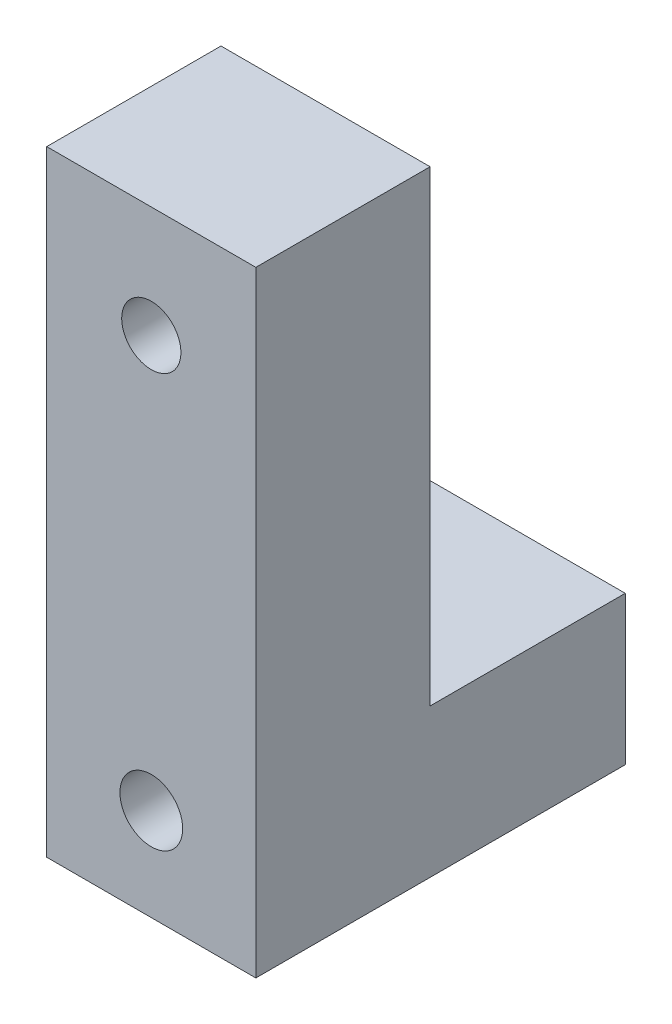
ISO-10303-21;
HEADER;
FILE_DESCRIPTION(('STEP AP214'),'2;1');
FILE_NAME('part.step','',(''),(''),'','','');
FILE_SCHEMA(('AUTOMOTIVE_DESIGN { 1 0 10303 214 1 1 1 1 }'));
ENDSEC;
DATA;
#1=APPLICATION_CONTEXT('core data for automotive mechanical design processes');
#2=APPLICATION_PROTOCOL_DEFINITION('international standard','automotive_design',2000,#1);
#3=PRODUCT_CONTEXT('',#1,'mechanical');
#4=PRODUCT('Part','Part','',(#3));
#5=PRODUCT_RELATED_PRODUCT_CATEGORY('part','',(#4));
#6=PRODUCT_DEFINITION_FORMATION('','',#4);
#7=PRODUCT_DEFINITION_CONTEXT('part definition',#1,'design');
#8=PRODUCT_DEFINITION('design','',#6,#7);
#9=PRODUCT_DEFINITION_SHAPE('','',#8);
#10=(LENGTH_UNIT() NAMED_UNIT(*) SI_UNIT(.MILLI.,.METRE.));
#11=(NAMED_UNIT(*) PLANE_ANGLE_UNIT() SI_UNIT($,.RADIAN.));
#12=(NAMED_UNIT(*) SI_UNIT($,.STERADIAN.) SOLID_ANGLE_UNIT());
#13=UNCERTAINTY_MEASURE_WITH_UNIT(LENGTH_MEASURE(1.E-05),#10,'distance_accuracy_value','');
#14=(GEOMETRIC_REPRESENTATION_CONTEXT(3) GLOBAL_UNCERTAINTY_ASSIGNED_CONTEXT((#13)) GLOBAL_UNIT_ASSIGNED_CONTEXT((#10,
#11,#12)) REPRESENTATION_CONTEXT('',''));
#15=CARTESIAN_POINT('',(0.,0.,0.));
#16=DIRECTION('',(0.,0.,1.));
#17=DIRECTION('',(1.,0.,0.));
#18=AXIS2_PLACEMENT_3D('',#15,#16,#17);
#19=CARTESIAN_POINT('',(15.,59.038200962956,71.5));
#20=DIRECTION('',(0.,0.,-1.));
#21=DIRECTION('',(-1.,0.,0.));
#22=AXIS2_PLACEMENT_3D('',#19,#20,#21);
#23=CYLINDRICAL_SURFACE('',#22,4.25);
#24=CARTESIAN_POINT('',(15.,59.038200962956,71.5));
#25=DIRECTION('',(0.,0.,-1.));
#26=DIRECTION('',(-1.,0.,0.));
#27=AXIS2_PLACEMENT_3D('',#24,#25,#26);
#28=CIRCLE('',#27,4.25);
#29=CARTESIAN_POINT('',(10.75,59.038200962956,71.5));
#30=VERTEX_POINT('',#29);
#31=EDGE_CURVE('E149',#30,#30,#28,.T.);
#32=ORIENTED_EDGE('',*,*,#31,.F.);
#33=EDGE_LOOP('',(#32));
#34=FACE_BOUND('',#33,.T.);
#35=CARTESIAN_POINT('',(15.,59.038200962956,54.5));
#36=DIRECTION('',(0.,0.,-1.));
#37=DIRECTION('',(-1.,0.,0.));
#38=AXIS2_PLACEMENT_3D('',#35,#36,#37);
#39=CIRCLE('',#38,4.25);
#40=CARTESIAN_POINT('',(10.75,59.038200962956,54.5));
#41=VERTEX_POINT('',#40);
#42=EDGE_CURVE('E37',#41,#41,#39,.F.);
#43=ORIENTED_EDGE('',*,*,#42,.F.);
#44=EDGE_LOOP('',(#43));
#45=FACE_BOUND('',#44,.T.);
#46=ADVANCED_FACE('F33',(#34,#45),#23,.F.);
#47=CARTESIAN_POINT('',(30.,8.00000000000004,46.5));
#48=DIRECTION('',(0.,-1.,0.));
#49=DIRECTION('',(0.,0.,-1.));
#50=AXIS2_PLACEMENT_3D('',#47,#48,#49);
#51=PLANE('',#50);
#52=DIRECTION('',(0.,0.,1.));
#53=VECTOR('',#52,1.);
#54=CARTESIAN_POINT('',(0.,8.00000000000004,46.5));
#55=LINE('',#54,#53);
#56=CARTESIAN_POINT('',(0.,8.00000000000004,18.5));
#57=VERTEX_POINT('',#56);
#58=CARTESIAN_POINT('',(0.,8.00000000000004,46.5));
#59=VERTEX_POINT('',#58);
#60=EDGE_CURVE('E120',#57,#59,#55,.T.);
#61=ORIENTED_EDGE('',*,*,#60,.T.);
#62=DIRECTION('',(-1.,0.,0.));
#63=VECTOR('',#62,1.);
#64=CARTESIAN_POINT('',(30.,8.00000000000004,46.5));
#65=LINE('',#64,#63);
#66=CARTESIAN_POINT('',(30.,8.00000000000004,46.5));
#67=VERTEX_POINT('',#66);
#68=EDGE_CURVE('E11',#67,#59,#65,.T.);
#69=ORIENTED_EDGE('',*,*,#68,.F.);
#70=DIRECTION('',(0.,0.,1.));
#71=VECTOR('',#70,1.);
#72=CARTESIAN_POINT('',(30.,8.00000000000004,46.5));
#73=LINE('',#72,#71);
#74=CARTESIAN_POINT('',(30.,8.00000000000004,18.5));
#75=VERTEX_POINT('',#74);
#76=EDGE_CURVE('E131',#75,#67,#73,.T.);
#77=ORIENTED_EDGE('',*,*,#76,.F.);
#78=DIRECTION('',(-1.,0.,0.));
#79=VECTOR('',#78,1.);
#80=CARTESIAN_POINT('',(30.,8.00000000000004,18.5));
#81=LINE('',#80,#79);
#82=EDGE_CURVE('E116',#75,#57,#81,.T.);
#83=ORIENTED_EDGE('',*,*,#82,.T.);
#84=EDGE_LOOP('',(#61,#69,#77,#83));
#85=FACE_BOUND('',#84,.T.);
#86=ADVANCED_FACE('F35',(#85),#51,.F.);
#87=CARTESIAN_POINT('',(30.,8.00000000000004,46.5));
#88=DIRECTION('',(0.,0.,1.));
#89=DIRECTION('',(1.,0.,0.));
#90=AXIS2_PLACEMENT_3D('',#87,#88,#89);
#91=PLANE('',#90);
#92=CARTESIAN_POINT('',(15.,59.038200962956,46.5));
#93=DIRECTION('',(0.,0.,-1.));
#94=DIRECTION('',(-1.,0.,0.));
#95=AXIS2_PLACEMENT_3D('',#92,#93,#94);
#96=CIRCLE('',#95,7.);
#97=CARTESIAN_POINT('',(8.,59.038200962956,46.5));
#98=VERTEX_POINT('',#97);
#99=EDGE_CURVE('E294',#98,#98,#96,.T.);
#100=ORIENTED_EDGE('',*,*,#99,.F.);
#101=EDGE_LOOP('',(#100));
#102=FACE_BOUND('',#101,.T.);
#103=DIRECTION('',(0.,1.,0.));
#104=VECTOR('',#103,1.);
#105=CARTESIAN_POINT('',(0.,8.00000000000004,46.5));
#106=LINE('',#105,#104);
#107=CARTESIAN_POINT('',(0.,75.,46.5));
#108=VERTEX_POINT('',#107);
#109=EDGE_CURVE('E123',#59,#108,#106,.T.);
#110=ORIENTED_EDGE('',*,*,#109,.T.);
#111=DIRECTION('',(-1.,0.,0.));
#112=VECTOR('',#111,1.);
#113=CARTESIAN_POINT('',(30.,75.,46.5));
#114=LINE('',#113,#112);
#115=CARTESIAN_POINT('',(30.,75.,46.5));
#116=VERTEX_POINT('',#115);
#117=EDGE_CURVE('E43',#116,#108,#114,.T.);
#118=ORIENTED_EDGE('',*,*,#117,.F.);
#119=DIRECTION('',(0.,1.,0.));
#120=VECTOR('',#119,1.);
#121=CARTESIAN_POINT('',(30.,8.00000000000004,46.5));
#122=LINE('',#121,#120);
#123=EDGE_CURVE('E89',#67,#116,#122,.T.);
#124=ORIENTED_EDGE('',*,*,#123,.F.);
#125=ORIENTED_EDGE('',*,*,#68,.T.);
#126=EDGE_LOOP('',(#110,#118,#124,#125));
#127=FACE_BOUND('',#126,.T.);
#128=ADVANCED_FACE('F157',(#102,#127),#91,.F.);
#129=CARTESIAN_POINT('',(30.,75.,71.5));
#130=DIRECTION('',(0.,-1.,0.));
#131=DIRECTION('',(0.,0.,-1.));
#132=AXIS2_PLACEMENT_3D('',#129,#130,#131);
#133=PLANE('',#132);
#134=DIRECTION('',(0.,0.,1.));
#135=VECTOR('',#134,1.);
#136=CARTESIAN_POINT('',(0.,75.,71.5));
#137=LINE('',#136,#135);
#138=CARTESIAN_POINT('',(0.,75.,71.5));
#139=VERTEX_POINT('',#138);
#140=EDGE_CURVE('E126',#108,#139,#137,.T.);
#141=ORIENTED_EDGE('',*,*,#140,.T.);
#142=DIRECTION('',(-1.,0.,0.));
#143=VECTOR('',#142,1.);
#144=CARTESIAN_POINT('',(30.,75.,71.5));
#145=LINE('',#144,#143);
#146=CARTESIAN_POINT('',(30.,75.,71.5));
#147=VERTEX_POINT('',#146);
#148=EDGE_CURVE('E111',#147,#139,#145,.T.);
#149=ORIENTED_EDGE('',*,*,#148,.F.);
#150=DIRECTION('',(0.,0.,1.));
#151=VECTOR('',#150,1.);
#152=CARTESIAN_POINT('',(30.,75.,71.5));
#153=LINE('',#152,#151);
#154=EDGE_CURVE('E102',#116,#147,#153,.T.);
#155=ORIENTED_EDGE('',*,*,#154,.F.);
#156=ORIENTED_EDGE('',*,*,#117,.T.);
#157=EDGE_LOOP('',(#141,#149,#155,#156));
#158=FACE_BOUND('',#157,.T.);
#159=ADVANCED_FACE('F160',(#158),#133,.F.);
#160=CARTESIAN_POINT('',(30.,-13.3,71.5));
#161=DIRECTION('',(0.,0.,-1.));
#162=DIRECTION('',(-1.,0.,0.));
#163=AXIS2_PLACEMENT_3D('',#160,#161,#162);
#164=PLANE('',#163);
#165=ORIENTED_EDGE('',*,*,#31,.T.);
#166=EDGE_LOOP('',(#165));
#167=FACE_BOUND('',#166,.T.);
#168=CARTESIAN_POINT('',(15.,0.,71.5));
#169=DIRECTION('',(0.,0.,-1.));
#170=DIRECTION('',(0.,1.,0.));
#171=AXIS2_PLACEMENT_3D('',#168,#169,#170);
#172=CIRCLE('',#171,4.5);
#173=CARTESIAN_POINT('',(15.,4.49999999999999,71.5));
#174=VERTEX_POINT('',#173);
#175=EDGE_CURVE('E138',#174,#174,#172,.T.);
#176=ORIENTED_EDGE('',*,*,#175,.T.);
#177=EDGE_LOOP('',(#176));
#178=FACE_BOUND('',#177,.T.);
#179=DIRECTION('',(0.,-1.,0.));
#180=VECTOR('',#179,1.);
#181=CARTESIAN_POINT('',(0.,-13.3,71.5));
#182=LINE('',#181,#180);
#183=CARTESIAN_POINT('',(0.,-13.3,71.5));
#184=VERTEX_POINT('',#183);
#185=EDGE_CURVE('E110',#139,#184,#182,.T.);
#186=ORIENTED_EDGE('',*,*,#185,.T.);
#187=DIRECTION('',(-1.,0.,0.));
#188=VECTOR('',#187,1.);
#189=CARTESIAN_POINT('',(30.,-13.3,71.5));
#190=LINE('',#189,#188);
#191=CARTESIAN_POINT('',(30.,-13.3,71.5));
#192=VERTEX_POINT('',#191);
#193=EDGE_CURVE('E107',#192,#184,#190,.T.);
#194=ORIENTED_EDGE('',*,*,#193,.F.);
#195=DIRECTION('',(0.,-1.,0.));
#196=VECTOR('',#195,1.);
#197=CARTESIAN_POINT('',(30.,-13.3,71.5));
#198=LINE('',#197,#196);
#199=EDGE_CURVE('E96',#147,#192,#198,.T.);
#200=ORIENTED_EDGE('',*,*,#199,.F.);
#201=ORIENTED_EDGE('',*,*,#148,.T.);
#202=EDGE_LOOP('',(#186,#194,#200,#201));
#203=FACE_BOUND('',#202,.T.);
#204=ADVANCED_FACE('F108',(#167,#178,#203),#164,.F.);
#205=CARTESIAN_POINT('',(30.,-13.3,18.5));
#206=DIRECTION('',(0.,1.,0.));
#207=DIRECTION('',(0.,0.,1.));
#208=AXIS2_PLACEMENT_3D('',#205,#206,#207);
#209=PLANE('',#208);
#210=DIRECTION('',(0.,0.,-1.));
#211=VECTOR('',#210,1.);
#212=CARTESIAN_POINT('',(0.,-13.3,18.5));
#213=LINE('',#212,#211);
#214=CARTESIAN_POINT('',(0.,-13.3,18.5));
#215=VERTEX_POINT('',#214);
#216=EDGE_CURVE('E75',#184,#215,#213,.T.);
#217=ORIENTED_EDGE('',*,*,#216,.T.);
#218=DIRECTION('',(-1.,0.,0.));
#219=VECTOR('',#218,1.);
#220=CARTESIAN_POINT('',(30.,-13.3,18.5));
#221=LINE('',#220,#219);
#222=CARTESIAN_POINT('',(30.,-13.3,18.5));
#223=VERTEX_POINT('',#222);
#224=EDGE_CURVE('E112',#223,#215,#221,.T.);
#225=ORIENTED_EDGE('',*,*,#224,.F.);
#226=DIRECTION('',(0.,0.,-1.));
#227=VECTOR('',#226,1.);
#228=CARTESIAN_POINT('',(30.,-13.3,18.5));
#229=LINE('',#228,#227);
#230=EDGE_CURVE('E100',#192,#223,#229,.T.);
#231=ORIENTED_EDGE('',*,*,#230,.F.);
#232=ORIENTED_EDGE('',*,*,#193,.T.);
#233=EDGE_LOOP('',(#217,#225,#231,#232));
#234=FACE_BOUND('',#233,.T.);
#235=ADVANCED_FACE('F114',(#234),#209,.F.);
#236=CARTESIAN_POINT('',(30.,8.00000000000004,18.5));
#237=DIRECTION('',(0.,0.,1.));
#238=DIRECTION('',(0.,-1.,0.));
#239=AXIS2_PLACEMENT_3D('',#236,#237,#238);
#240=PLANE('',#239);
#241=CARTESIAN_POINT('',(15.,0.,18.5));
#242=DIRECTION('',(0.,0.,-1.));
#243=DIRECTION('',(0.,1.,0.));
#244=AXIS2_PLACEMENT_3D('',#241,#242,#243);
#245=CIRCLE('',#244,2.65);
#246=CARTESIAN_POINT('',(15.,2.65,18.5));
#247=VERTEX_POINT('',#246);
#248=EDGE_CURVE('E124',#247,#247,#245,.T.);
#249=ORIENTED_EDGE('',*,*,#248,.F.);
#250=EDGE_LOOP('',(#249));
#251=FACE_BOUND('',#250,.T.);
#252=DIRECTION('',(0.,1.,0.));
#253=VECTOR('',#252,1.);
#254=CARTESIAN_POINT('',(0.,8.00000000000004,18.5));
#255=LINE('',#254,#253);
#256=EDGE_CURVE('E81',#215,#57,#255,.T.);
#257=ORIENTED_EDGE('',*,*,#256,.T.);
#258=ORIENTED_EDGE('',*,*,#82,.F.);
#259=DIRECTION('',(0.,1.,0.));
#260=VECTOR('',#259,1.);
#261=CARTESIAN_POINT('',(30.,8.00000000000004,18.5));
#262=LINE('',#261,#260);
#263=EDGE_CURVE('E52',#223,#75,#262,.T.);
#264=ORIENTED_EDGE('',*,*,#263,.F.);
#265=ORIENTED_EDGE('',*,*,#224,.T.);
#266=EDGE_LOOP('',(#257,#258,#264,#265));
#267=FACE_BOUND('',#266,.T.);
#268=ADVANCED_FACE('F165',(#251,#267),#240,.F.);
#269=CARTESIAN_POINT('',(30.,0.,0.));
#270=DIRECTION('',(-1.,0.,0.));
#271=DIRECTION('',(0.,0.,1.));
#272=AXIS2_PLACEMENT_3D('',#269,#270,#271);
#273=PLANE('',#272);
#274=ORIENTED_EDGE('',*,*,#76,.T.);
#275=ORIENTED_EDGE('',*,*,#123,.T.);
#276=ORIENTED_EDGE('',*,*,#154,.T.);
#277=ORIENTED_EDGE('',*,*,#199,.T.);
#278=ORIENTED_EDGE('',*,*,#230,.T.);
#279=ORIENTED_EDGE('',*,*,#263,.T.);
#280=EDGE_LOOP('',(#274,#275,#276,#277,#278,#279));
#281=FACE_BOUND('',#280,.T.);
#282=ADVANCED_FACE('F98',(#281),#273,.F.);
#283=CARTESIAN_POINT('',(0.,0.,0.));
#284=DIRECTION('',(-1.,0.,0.));
#285=DIRECTION('',(0.,0.,1.));
#286=AXIS2_PLACEMENT_3D('',#283,#284,#285);
#287=PLANE('',#286);
#288=ORIENTED_EDGE('',*,*,#60,.F.);
#289=ORIENTED_EDGE('',*,*,#256,.F.);
#290=ORIENTED_EDGE('',*,*,#216,.F.);
#291=ORIENTED_EDGE('',*,*,#185,.F.);
#292=ORIENTED_EDGE('',*,*,#140,.F.);
#293=ORIENTED_EDGE('',*,*,#109,.F.);
#294=EDGE_LOOP('',(#288,#289,#290,#291,#292,#293));
#295=FACE_BOUND('',#294,.T.);
#296=ADVANCED_FACE('F163',(#295),#287,.T.);
#297=CARTESIAN_POINT('',(15.,0.,71.5));
#298=DIRECTION('',(0.,0.,-1.));
#299=DIRECTION('',(0.,1.,0.));
#300=AXIS2_PLACEMENT_3D('',#297,#298,#299);
#301=CYLINDRICAL_SURFACE('',#300,2.65);
#302=CARTESIAN_POINT('',(15.,0.,32.5));
#303=DIRECTION('',(0.,0.,-1.));
#304=DIRECTION('',(0.,1.,0.));
#305=AXIS2_PLACEMENT_3D('',#302,#303,#304);
#306=CIRCLE('',#305,2.65);
#307=CARTESIAN_POINT('',(15.,2.65,32.5));
#308=VERTEX_POINT('',#307);
#309=EDGE_CURVE('E136',#308,#308,#306,.F.);
#310=ORIENTED_EDGE('',*,*,#309,.T.);
#311=EDGE_LOOP('',(#310));
#312=FACE_BOUND('',#311,.T.);
#313=ORIENTED_EDGE('',*,*,#248,.T.);
#314=EDGE_LOOP('',(#313));
#315=FACE_BOUND('',#314,.T.);
#316=ADVANCED_FACE('F193',(#312,#315),#301,.F.);
#317=CARTESIAN_POINT('',(15.,0.,32.5));
#318=DIRECTION('',(0.,0.,-1.));
#319=DIRECTION('',(0.,1.,0.));
#320=AXIS2_PLACEMENT_3D('',#317,#318,#319);
#321=PLANE('',#320);
#322=CARTESIAN_POINT('',(15.,0.,32.5));
#323=DIRECTION('',(0.,0.,-1.));
#324=DIRECTION('',(0.,1.,0.));
#325=AXIS2_PLACEMENT_3D('',#322,#323,#324);
#326=CIRCLE('',#325,4.5);
#327=CARTESIAN_POINT('',(15.,4.5,32.5));
#328=VERTEX_POINT('',#327);
#329=EDGE_CURVE('E144',#328,#328,#326,.T.);
#330=ORIENTED_EDGE('',*,*,#329,.F.);
#331=EDGE_LOOP('',(#330));
#332=FACE_BOUND('',#331,.T.);
#333=ORIENTED_EDGE('',*,*,#309,.F.);
#334=EDGE_LOOP('',(#333));
#335=FACE_BOUND('',#334,.T.);
#336=ADVANCED_FACE('F189',(#332,#335),#321,.F.);
#337=CARTESIAN_POINT('',(15.,0.,71.5));
#338=DIRECTION('',(0.,0.,-1.));
#339=DIRECTION('',(0.,1.,0.));
#340=AXIS2_PLACEMENT_3D('',#337,#338,#339);
#341=CYLINDRICAL_SURFACE('',#340,4.5);
#342=ORIENTED_EDGE('',*,*,#175,.F.);
#343=EDGE_LOOP('',(#342));
#344=FACE_BOUND('',#343,.T.);
#345=ORIENTED_EDGE('',*,*,#329,.T.);
#346=EDGE_LOOP('',(#345));
#347=FACE_BOUND('',#346,.T.);
#348=ADVANCED_FACE('F192',(#344,#347),#341,.F.);
#349=CARTESIAN_POINT('',(15.,59.038200962956,54.5));
#350=DIRECTION('',(0.,0.,-1.));
#351=DIRECTION('',(-1.,0.,0.));
#352=AXIS2_PLACEMENT_3D('',#349,#350,#351);
#353=PLANE('',#352);
#354=CARTESIAN_POINT('',(15.,59.038200962956,54.5));
#355=DIRECTION('',(0.,0.,-1.));
#356=DIRECTION('',(-1.,0.,0.));
#357=AXIS2_PLACEMENT_3D('',#354,#355,#356);
#358=CIRCLE('',#357,7.);
#359=CARTESIAN_POINT('',(8.,59.038200962956,54.5));
#360=VERTEX_POINT('',#359);
#361=EDGE_CURVE('E296',#360,#360,#358,.T.);
#362=ORIENTED_EDGE('',*,*,#361,.T.);
#363=EDGE_LOOP('',(#362));
#364=FACE_BOUND('',#363,.T.);
#365=ORIENTED_EDGE('',*,*,#42,.T.);
#366=EDGE_LOOP('',(#365));
#367=FACE_BOUND('',#366,.T.);
#368=ADVANCED_FACE('F197',(#364,#367),#353,.T.);
#369=CARTESIAN_POINT('',(15.,59.038200962956,54.5));
#370=DIRECTION('',(0.,0.,-1.));
#371=DIRECTION('',(-1.,0.,0.));
#372=AXIS2_PLACEMENT_3D('',#369,#370,#371);
#373=CYLINDRICAL_SURFACE('',#372,7.);
#374=ORIENTED_EDGE('',*,*,#361,.F.);
#375=EDGE_LOOP('',(#374));
#376=FACE_BOUND('',#375,.T.);
#377=ORIENTED_EDGE('',*,*,#99,.T.);
#378=EDGE_LOOP('',(#377));
#379=FACE_BOUND('',#378,.T.);
#380=ADVANCED_FACE('F187',(#376,#379),#373,.F.);
#381=CLOSED_SHELL('',(#46,#86,#128,#159,#204,#235,#268,#282,#296,#316,#336,#348,#368,#380));
#382=MANIFOLD_SOLID_BREP('B2',#381);
#383=ADVANCED_BREP_SHAPE_REPRESENTATION('',(#18,#382),#14);
#384=SHAPE_DEFINITION_REPRESENTATION(#9,#383);
ENDSEC;
END-ISO-10303-21;
